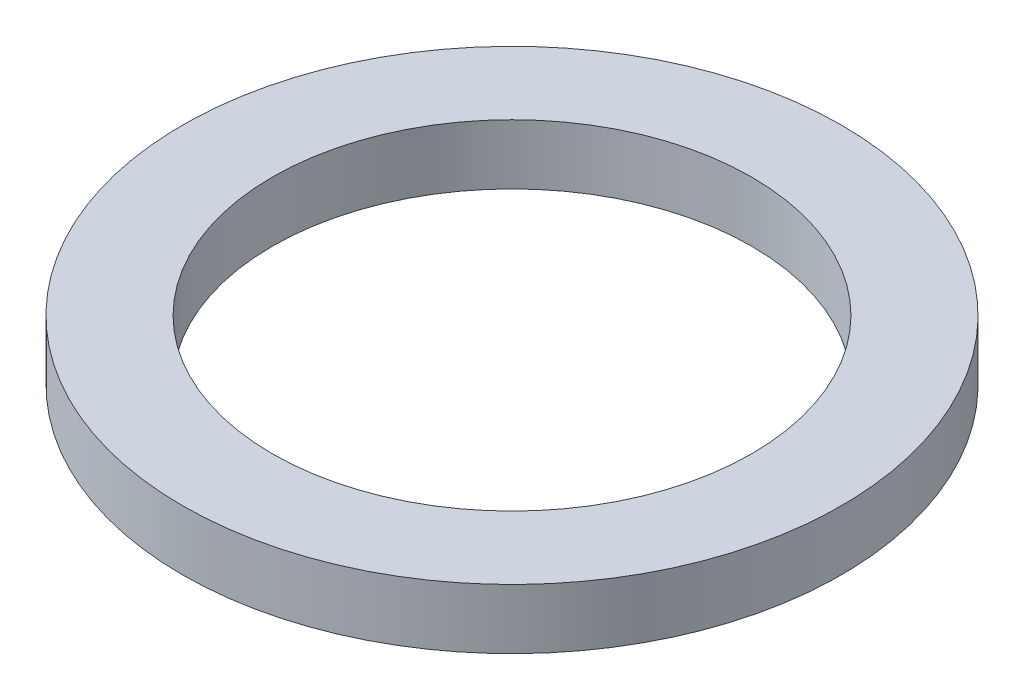
ISO-10303-21;
HEADER;
FILE_DESCRIPTION(('STEP AP214'),'2;1');
FILE_NAME('part.step','',(''),(''),'','','');
FILE_SCHEMA(('AUTOMOTIVE_DESIGN { 1 0 10303 214 1 1 1 1 }'));
ENDSEC;
DATA;
#1=APPLICATION_CONTEXT('core data for automotive mechanical design processes');
#2=APPLICATION_PROTOCOL_DEFINITION('international standard','automotive_design',2000,#1);
#3=PRODUCT_CONTEXT('',#1,'mechanical');
#4=PRODUCT('Part','Part','',(#3));
#5=PRODUCT_RELATED_PRODUCT_CATEGORY('part','',(#4));
#6=PRODUCT_DEFINITION_FORMATION('','',#4);
#7=PRODUCT_DEFINITION_CONTEXT('part definition',#1,'design');
#8=PRODUCT_DEFINITION('design','',#6,#7);
#9=PRODUCT_DEFINITION_SHAPE('','',#8);
#10=(LENGTH_UNIT() NAMED_UNIT(*) SI_UNIT(.MILLI.,.METRE.));
#11=(NAMED_UNIT(*) PLANE_ANGLE_UNIT() SI_UNIT($,.RADIAN.));
#12=(NAMED_UNIT(*) SI_UNIT($,.STERADIAN.) SOLID_ANGLE_UNIT());
#13=UNCERTAINTY_MEASURE_WITH_UNIT(LENGTH_MEASURE(1.E-05),#10,'distance_accuracy_value','');
#14=(GEOMETRIC_REPRESENTATION_CONTEXT(3) GLOBAL_UNCERTAINTY_ASSIGNED_CONTEXT((#13)) GLOBAL_UNIT_ASSIGNED_CONTEXT((#10,
#11,#12)) REPRESENTATION_CONTEXT('',''));
#15=CARTESIAN_POINT('',(0.,0.,0.));
#16=DIRECTION('',(0.,0.,1.));
#17=DIRECTION('',(1.,0.,0.));
#18=AXIS2_PLACEMENT_3D('',#15,#16,#17);
#19=CARTESIAN_POINT('',(0.,0.5,0.));
#20=DIRECTION('',(0.,1.,0.));
#21=DIRECTION('',(0.,0.,1.));
#22=AXIS2_PLACEMENT_3D('',#19,#20,#21);
#23=PLANE('',#22);
#24=CARTESIAN_POINT('',(0.,0.5,0.));
#25=DIRECTION('',(0.,1.,0.));
#26=DIRECTION('',(0.,0.,1.));
#27=AXIS2_PLACEMENT_3D('',#24,#25,#26);
#28=CIRCLE('',#27,5.5);
#29=CARTESIAN_POINT('',(0.,0.5,5.5));
#30=VERTEX_POINT('',#29);
#31=EDGE_CURVE('E10',#30,#30,#28,.T.);
#32=ORIENTED_EDGE('',*,*,#31,.T.);
#33=EDGE_LOOP('',(#32));
#34=FACE_BOUND('',#33,.T.);
#35=CARTESIAN_POINT('',(0.,0.5,0.));
#36=DIRECTION('',(0.,1.,0.));
#37=DIRECTION('',(0.,0.,1.));
#38=AXIS2_PLACEMENT_3D('',#35,#36,#37);
#39=CIRCLE('',#38,4.);
#40=CARTESIAN_POINT('',(0.,0.5,4.));
#41=VERTEX_POINT('',#40);
#42=EDGE_CURVE('E43',#41,#41,#39,.T.);
#43=ORIENTED_EDGE('',*,*,#42,.F.);
#44=EDGE_LOOP('',(#43));
#45=FACE_BOUND('',#44,.T.);
#46=ADVANCED_FACE('F32',(#34,#45),#23,.T.);
#47=CARTESIAN_POINT('',(0.,-0.5,0.));
#48=DIRECTION('',(0.,1.,0.));
#49=DIRECTION('',(0.,0.,1.));
#50=AXIS2_PLACEMENT_3D('',#47,#48,#49);
#51=PLANE('',#50);
#52=CARTESIAN_POINT('',(0.,-0.5,0.));
#53=DIRECTION('',(0.,1.,0.));
#54=DIRECTION('',(0.,0.,1.));
#55=AXIS2_PLACEMENT_3D('',#52,#53,#54);
#56=CIRCLE('',#55,5.5);
#57=CARTESIAN_POINT('',(0.,-0.5,5.5));
#58=VERTEX_POINT('',#57);
#59=EDGE_CURVE('E36',#58,#58,#56,.T.);
#60=ORIENTED_EDGE('',*,*,#59,.F.);
#61=EDGE_LOOP('',(#60));
#62=FACE_BOUND('',#61,.T.);
#63=CARTESIAN_POINT('',(0.,-0.5,0.));
#64=DIRECTION('',(0.,1.,0.));
#65=DIRECTION('',(0.,0.,1.));
#66=AXIS2_PLACEMENT_3D('',#63,#64,#65);
#67=CIRCLE('',#66,4.);
#68=CARTESIAN_POINT('',(0.,-0.5,4.));
#69=VERTEX_POINT('',#68);
#70=EDGE_CURVE('E45',#69,#69,#67,.T.);
#71=ORIENTED_EDGE('',*,*,#70,.T.);
#72=EDGE_LOOP('',(#71));
#73=FACE_BOUND('',#72,.T.);
#74=ADVANCED_FACE('F55',(#62,#73),#51,.F.);
#75=CARTESIAN_POINT('',(0.,0.5,0.));
#76=DIRECTION('',(0.,-1.,0.));
#77=DIRECTION('',(0.,0.,-1.));
#78=AXIS2_PLACEMENT_3D('',#75,#76,#77);
#79=CYLINDRICAL_SURFACE('',#78,5.5);
#80=ORIENTED_EDGE('',*,*,#31,.F.);
#81=EDGE_LOOP('',(#80));
#82=FACE_BOUND('',#81,.T.);
#83=ORIENTED_EDGE('',*,*,#59,.T.);
#84=EDGE_LOOP('',(#83));
#85=FACE_BOUND('',#84,.T.);
#86=ADVANCED_FACE('F34',(#82,#85),#79,.T.);
#87=CARTESIAN_POINT('',(0.,0.5,0.));
#88=DIRECTION('',(0.,-1.,0.));
#89=DIRECTION('',(0.,0.,-1.));
#90=AXIS2_PLACEMENT_3D('',#87,#88,#89);
#91=CYLINDRICAL_SURFACE('',#90,4.);
#92=ORIENTED_EDGE('',*,*,#42,.T.);
#93=EDGE_LOOP('',(#92));
#94=FACE_BOUND('',#93,.T.);
#95=ORIENTED_EDGE('',*,*,#70,.F.);
#96=EDGE_LOOP('',(#95));
#97=FACE_BOUND('',#96,.T.);
#98=ADVANCED_FACE('F51',(#94,#97),#91,.F.);
#99=CLOSED_SHELL('',(#46,#74,#86,#98));
#100=MANIFOLD_SOLID_BREP('B2',#99);
#101=ADVANCED_BREP_SHAPE_REPRESENTATION('',(#18,#100),#14);
#102=SHAPE_DEFINITION_REPRESENTATION(#9,#101);
ENDSEC;
END-ISO-10303-21;
